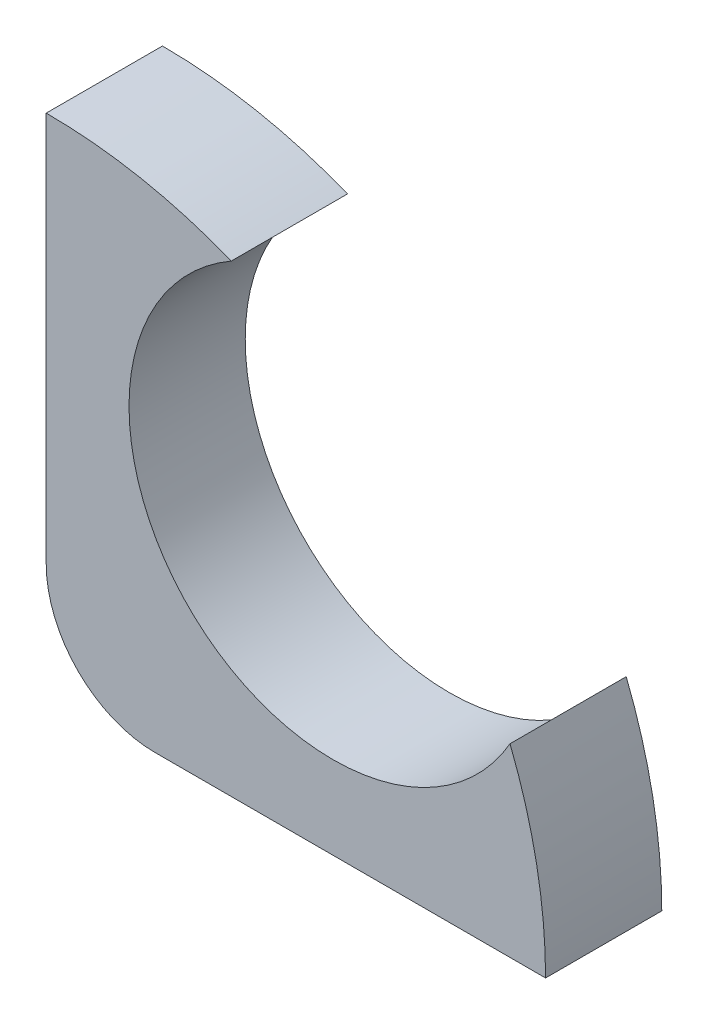
ISO-10303-21;
HEADER;
FILE_DESCRIPTION(('STEP AP214'),'2;1');
FILE_NAME('part.step','',(''),(''),'','','');
FILE_SCHEMA(('AUTOMOTIVE_DESIGN { 1 0 10303 214 1 1 1 1 }'));
ENDSEC;
DATA;
#1=APPLICATION_CONTEXT('core data for automotive mechanical design processes');
#2=APPLICATION_PROTOCOL_DEFINITION('international standard','automotive_design',2000,#1);
#3=PRODUCT_CONTEXT('',#1,'mechanical');
#4=PRODUCT('Part','Part','',(#3));
#5=PRODUCT_RELATED_PRODUCT_CATEGORY('part','',(#4));
#6=PRODUCT_DEFINITION_FORMATION('','',#4);
#7=PRODUCT_DEFINITION_CONTEXT('part definition',#1,'design');
#8=PRODUCT_DEFINITION('design','',#6,#7);
#9=PRODUCT_DEFINITION_SHAPE('','',#8);
#10=(LENGTH_UNIT() NAMED_UNIT(*) SI_UNIT(.MILLI.,.METRE.));
#11=(NAMED_UNIT(*) PLANE_ANGLE_UNIT() SI_UNIT($,.RADIAN.));
#12=(NAMED_UNIT(*) SI_UNIT($,.STERADIAN.) SOLID_ANGLE_UNIT());
#13=UNCERTAINTY_MEASURE_WITH_UNIT(LENGTH_MEASURE(1.E-05),#10,'distance_accuracy_value','');
#14=(GEOMETRIC_REPRESENTATION_CONTEXT(3) GLOBAL_UNCERTAINTY_ASSIGNED_CONTEXT((#13)) GLOBAL_UNIT_ASSIGNED_CONTEXT((#10,
#11,#12)) REPRESENTATION_CONTEXT('',''));
#15=CARTESIAN_POINT('',(0.,0.,0.));
#16=DIRECTION('',(0.,0.,1.));
#17=DIRECTION('',(1.,0.,0.));
#18=AXIS2_PLACEMENT_3D('',#15,#16,#17);
#19=CARTESIAN_POINT('',(-19.95,-19.95,1.));
#20=DIRECTION('',(0.,0.,-1.));
#21=DIRECTION('',(0.,-1.,0.));
#22=AXIS2_PLACEMENT_3D('',#19,#20,#21);
#23=PLANE('',#22);
#24=CARTESIAN_POINT('',(-19.95,-19.95,1.));
#25=DIRECTION('',(0.,0.,-1.));
#26=DIRECTION('',(-1.,0.,0.));
#27=AXIS2_PLACEMENT_3D('',#24,#25,#26);
#28=CIRCLE('',#27,6.875);
#29=CARTESIAN_POINT('',(-13.5646574803851,-17.4018583423997,1.));
#30=VERTEX_POINT('',#29);
#31=CARTESIAN_POINT('',(-13.075,-19.95,1.));
#32=VERTEX_POINT('',#31);
#33=EDGE_CURVE('E100',#30,#32,#28,.T.);
#34=ORIENTED_EDGE('',*,*,#33,.F.);
#35=CARTESIAN_POINT('',(-16.,-16.,1.));
#36=DIRECTION('',(0.,0.,1.));
#37=DIRECTION('',(-1.,0.,0.));
#38=AXIS2_PLACEMENT_3D('',#35,#36,#37);
#39=CIRCLE('',#38,2.81);
#40=CARTESIAN_POINT('',(-17.4018583423997,-13.5646574803851,1.));
#41=VERTEX_POINT('',#40);
#42=EDGE_CURVE('E26',#41,#30,#39,.T.);
#43=ORIENTED_EDGE('',*,*,#42,.F.);
#44=CARTESIAN_POINT('',(-19.95,-19.95,1.));
#45=DIRECTION('',(0.,0.,-1.));
#46=DIRECTION('',(-1.,0.,0.));
#47=AXIS2_PLACEMENT_3D('',#44,#45,#46);
#48=CIRCLE('',#47,6.875);
#49=CARTESIAN_POINT('',(-19.95,-13.075,1.));
#50=VERTEX_POINT('',#49);
#51=EDGE_CURVE('E124',#50,#41,#48,.T.);
#52=ORIENTED_EDGE('',*,*,#51,.F.);
#53=DIRECTION('',(0.,1.,0.));
#54=VECTOR('',#53,1.);
#55=CARTESIAN_POINT('',(-19.95,-18.45,1.));
#56=LINE('',#55,#54);
#57=CARTESIAN_POINT('',(-19.95,-18.45,1.));
#58=VERTEX_POINT('',#57);
#59=EDGE_CURVE('E115',#58,#50,#56,.T.);
#60=ORIENTED_EDGE('',*,*,#59,.F.);
#61=CARTESIAN_POINT('',(-18.45,-18.45,1.));
#62=DIRECTION('',(0.,0.,-1.));
#63=DIRECTION('',(-1.,0.,0.));
#64=AXIS2_PLACEMENT_3D('',#61,#62,#63);
#65=CIRCLE('',#64,1.5);
#66=CARTESIAN_POINT('',(-18.45,-19.95,1.));
#67=VERTEX_POINT('',#66);
#68=EDGE_CURVE('E109',#67,#58,#65,.T.);
#69=ORIENTED_EDGE('',*,*,#68,.F.);
#70=DIRECTION('',(-1.,0.,0.));
#71=VECTOR('',#70,1.);
#72=CARTESIAN_POINT('',(-13.075,-19.95,1.));
#73=LINE('',#72,#71);
#74=EDGE_CURVE('E90',#32,#67,#73,.T.);
#75=ORIENTED_EDGE('',*,*,#74,.F.);
#76=EDGE_LOOP('',(#34,#43,#52,#60,#69,#75));
#77=FACE_BOUND('',#76,.T.);
#78=ADVANCED_FACE('F16',(#77),#23,.F.);
#79=CARTESIAN_POINT('',(-19.95,-19.95,-0.6));
#80=DIRECTION('',(0.,0.,-1.));
#81=DIRECTION('',(0.,-1.,0.));
#82=AXIS2_PLACEMENT_3D('',#79,#80,#81);
#83=PLANE('',#82);
#84=CARTESIAN_POINT('',(-19.95,-19.95,-0.6));
#85=DIRECTION('',(0.,0.,-1.));
#86=DIRECTION('',(-1.,0.,0.));
#87=AXIS2_PLACEMENT_3D('',#84,#85,#86);
#88=CIRCLE('',#87,6.875);
#89=CARTESIAN_POINT('',(-13.5646574803851,-17.4018583423997,-0.6));
#90=VERTEX_POINT('',#89);
#91=CARTESIAN_POINT('',(-13.075,-19.95,-0.6));
#92=VERTEX_POINT('',#91);
#93=EDGE_CURVE('E20',#90,#92,#88,.T.);
#94=ORIENTED_EDGE('',*,*,#93,.T.);
#95=DIRECTION('',(-1.,0.,0.));
#96=VECTOR('',#95,1.);
#97=CARTESIAN_POINT('',(-13.075,-19.95,-0.6));
#98=LINE('',#97,#96);
#99=CARTESIAN_POINT('',(-18.45,-19.95,-0.6));
#100=VERTEX_POINT('',#99);
#101=EDGE_CURVE('E114',#92,#100,#98,.T.);
#102=ORIENTED_EDGE('',*,*,#101,.T.);
#103=CARTESIAN_POINT('',(-18.45,-18.45,-0.6));
#104=DIRECTION('',(0.,0.,-1.));
#105=DIRECTION('',(-1.,0.,0.));
#106=AXIS2_PLACEMENT_3D('',#103,#104,#105);
#107=CIRCLE('',#106,1.5);
#108=CARTESIAN_POINT('',(-19.95,-18.45,-0.6));
#109=VERTEX_POINT('',#108);
#110=EDGE_CURVE('E119',#100,#109,#107,.T.);
#111=ORIENTED_EDGE('',*,*,#110,.T.);
#112=DIRECTION('',(0.,1.,0.));
#113=VECTOR('',#112,1.);
#114=CARTESIAN_POINT('',(-19.95,-18.45,-0.6));
#115=LINE('',#114,#113);
#116=CARTESIAN_POINT('',(-19.95,-13.075,-0.6));
#117=VERTEX_POINT('',#116);
#118=EDGE_CURVE('E128',#109,#117,#115,.T.);
#119=ORIENTED_EDGE('',*,*,#118,.T.);
#120=CARTESIAN_POINT('',(-19.95,-19.95,-0.6));
#121=DIRECTION('',(0.,0.,-1.));
#122=DIRECTION('',(-1.,0.,0.));
#123=AXIS2_PLACEMENT_3D('',#120,#121,#122);
#124=CIRCLE('',#123,6.875);
#125=CARTESIAN_POINT('',(-17.4018583423997,-13.5646574803851,-0.6));
#126=VERTEX_POINT('',#125);
#127=EDGE_CURVE('E82',#117,#126,#124,.T.);
#128=ORIENTED_EDGE('',*,*,#127,.T.);
#129=CARTESIAN_POINT('',(-16.,-16.,-0.6));
#130=DIRECTION('',(0.,0.,1.));
#131=DIRECTION('',(-1.,0.,0.));
#132=AXIS2_PLACEMENT_3D('',#129,#130,#131);
#133=CIRCLE('',#132,2.81);
#134=EDGE_CURVE('E11',#126,#90,#133,.T.);
#135=ORIENTED_EDGE('',*,*,#134,.T.);
#136=EDGE_LOOP('',(#94,#102,#111,#119,#128,#135));
#137=FACE_BOUND('',#136,.T.);
#138=ADVANCED_FACE('F77',(#137),#83,.T.);
#139=CARTESIAN_POINT('',(-16.,-16.,-0.6));
#140=DIRECTION('',(0.,0.,1.));
#141=DIRECTION('',(1.,0.,0.));
#142=AXIS2_PLACEMENT_3D('',#139,#140,#141);
#143=CYLINDRICAL_SURFACE('',#142,2.81);
#144=ORIENTED_EDGE('',*,*,#42,.T.);
#145=DIRECTION('',(0.,0.,1.));
#146=VECTOR('',#145,1.);
#147=CARTESIAN_POINT('',(-13.5646574803851,-17.4018583423997,-0.6));
#148=LINE('',#147,#146);
#149=EDGE_CURVE('E85',#90,#30,#148,.T.);
#150=ORIENTED_EDGE('',*,*,#149,.F.);
#151=ORIENTED_EDGE('',*,*,#134,.F.);
#152=DIRECTION('',(0.,0.,1.));
#153=VECTOR('',#152,1.);
#154=CARTESIAN_POINT('',(-17.4018583423997,-13.5646574803851,-0.6));
#155=LINE('',#154,#153);
#156=EDGE_CURVE('E127',#126,#41,#155,.T.);
#157=ORIENTED_EDGE('',*,*,#156,.T.);
#158=EDGE_LOOP('',(#144,#150,#151,#157));
#159=FACE_BOUND('',#158,.T.);
#160=ADVANCED_FACE('F86',(#159),#143,.F.);
#161=CARTESIAN_POINT('',(-19.95,-19.95,-0.6));
#162=DIRECTION('',(0.,0.,1.));
#163=DIRECTION('',(1.,0.,0.));
#164=AXIS2_PLACEMENT_3D('',#161,#162,#163);
#165=CYLINDRICAL_SURFACE('',#164,6.875);
#166=ORIENTED_EDGE('',*,*,#51,.T.);
#167=ORIENTED_EDGE('',*,*,#156,.F.);
#168=ORIENTED_EDGE('',*,*,#127,.F.);
#169=DIRECTION('',(0.,0.,1.));
#170=VECTOR('',#169,1.);
#171=CARTESIAN_POINT('',(-19.95,-13.075,-0.6));
#172=LINE('',#171,#170);
#173=EDGE_CURVE('E118',#117,#50,#172,.T.);
#174=ORIENTED_EDGE('',*,*,#173,.T.);
#175=EDGE_LOOP('',(#166,#167,#168,#174));
#176=FACE_BOUND('',#175,.T.);
#177=ADVANCED_FACE('F154',(#176),#165,.T.);
#178=CARTESIAN_POINT('',(-19.95,-18.45,-0.6));
#179=DIRECTION('',(1.,0.,0.));
#180=DIRECTION('',(0.,1.,0.));
#181=AXIS2_PLACEMENT_3D('',#178,#179,#180);
#182=PLANE('',#181);
#183=ORIENTED_EDGE('',*,*,#59,.T.);
#184=ORIENTED_EDGE('',*,*,#173,.F.);
#185=ORIENTED_EDGE('',*,*,#118,.F.);
#186=DIRECTION('',(0.,0.,1.));
#187=VECTOR('',#186,1.);
#188=CARTESIAN_POINT('',(-19.95,-18.45,-0.6));
#189=LINE('',#188,#187);
#190=EDGE_CURVE('E113',#109,#58,#189,.T.);
#191=ORIENTED_EDGE('',*,*,#190,.T.);
#192=EDGE_LOOP('',(#183,#184,#185,#191));
#193=FACE_BOUND('',#192,.T.);
#194=ADVANCED_FACE('F158',(#193),#182,.F.);
#195=CARTESIAN_POINT('',(-18.45,-18.45,-0.6));
#196=DIRECTION('',(0.,0.,1.));
#197=DIRECTION('',(1.,0.,0.));
#198=AXIS2_PLACEMENT_3D('',#195,#196,#197);
#199=CYLINDRICAL_SURFACE('',#198,1.5);
#200=ORIENTED_EDGE('',*,*,#68,.T.);
#201=ORIENTED_EDGE('',*,*,#190,.F.);
#202=ORIENTED_EDGE('',*,*,#110,.F.);
#203=DIRECTION('',(0.,0.,1.));
#204=VECTOR('',#203,1.);
#205=CARTESIAN_POINT('',(-18.45,-19.95,-0.6));
#206=LINE('',#205,#204);
#207=EDGE_CURVE('E123',#100,#67,#206,.T.);
#208=ORIENTED_EDGE('',*,*,#207,.T.);
#209=EDGE_LOOP('',(#200,#201,#202,#208));
#210=FACE_BOUND('',#209,.T.);
#211=ADVANCED_FACE('F176',(#210),#199,.T.);
#212=CARTESIAN_POINT('',(-13.075,-19.95,-0.6));
#213=DIRECTION('',(0.,1.,0.));
#214=DIRECTION('',(1.,0.,0.));
#215=AXIS2_PLACEMENT_3D('',#212,#213,#214);
#216=PLANE('',#215);
#217=ORIENTED_EDGE('',*,*,#74,.T.);
#218=ORIENTED_EDGE('',*,*,#207,.F.);
#219=ORIENTED_EDGE('',*,*,#101,.F.);
#220=DIRECTION('',(0.,0.,1.));
#221=VECTOR('',#220,1.);
#222=CARTESIAN_POINT('',(-13.075,-19.95,-0.6));
#223=LINE('',#222,#221);
#224=EDGE_CURVE('E94',#92,#32,#223,.T.);
#225=ORIENTED_EDGE('',*,*,#224,.T.);
#226=EDGE_LOOP('',(#217,#218,#219,#225));
#227=FACE_BOUND('',#226,.T.);
#228=ADVANCED_FACE('F18',(#227),#216,.F.);
#229=CARTESIAN_POINT('',(-19.95,-19.95,-0.6));
#230=DIRECTION('',(0.,0.,1.));
#231=DIRECTION('',(1.,0.,0.));
#232=AXIS2_PLACEMENT_3D('',#229,#230,#231);
#233=CYLINDRICAL_SURFACE('',#232,6.875);
#234=ORIENTED_EDGE('',*,*,#33,.T.);
#235=ORIENTED_EDGE('',*,*,#224,.F.);
#236=ORIENTED_EDGE('',*,*,#93,.F.);
#237=ORIENTED_EDGE('',*,*,#149,.T.);
#238=EDGE_LOOP('',(#234,#235,#236,#237));
#239=FACE_BOUND('',#238,.T.);
#240=ADVANCED_FACE('F92',(#239),#233,.T.);
#241=CLOSED_SHELL('',(#78,#138,#160,#177,#194,#211,#228,#240));
#242=MANIFOLD_SOLID_BREP('B1',#241);
#243=ADVANCED_BREP_SHAPE_REPRESENTATION('',(#18,#242),#14);
#244=SHAPE_DEFINITION_REPRESENTATION(#9,#243);
ENDSEC;
END-ISO-10303-21;
